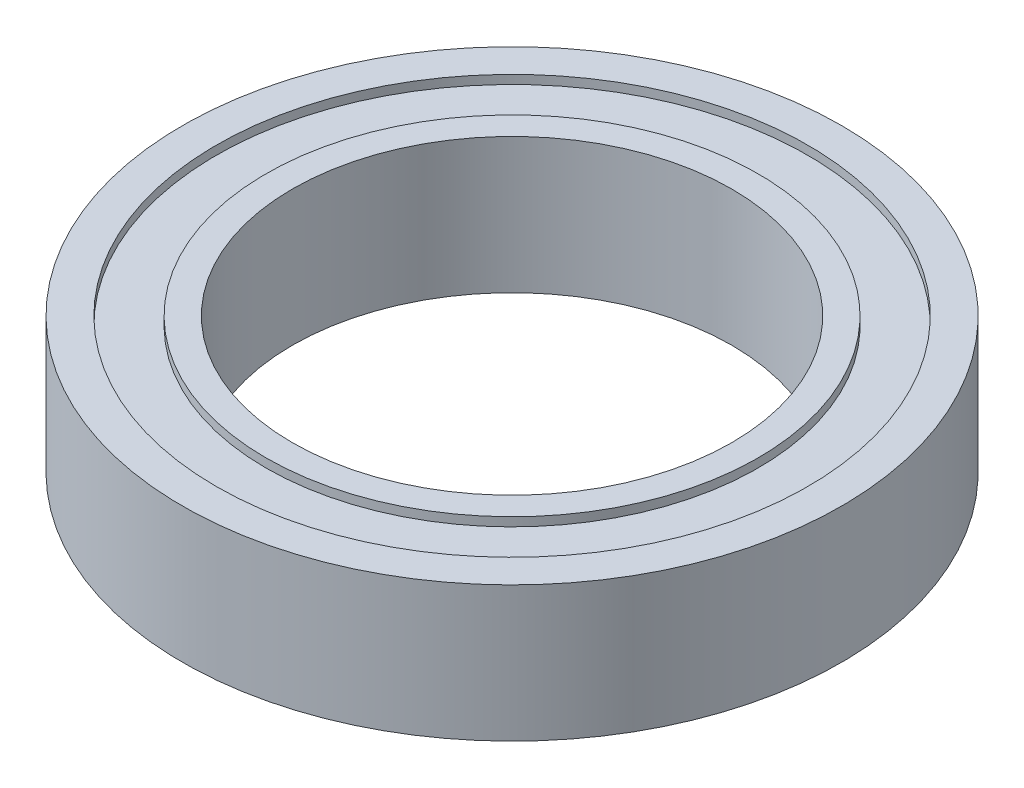
ISO-10303-21;
HEADER;
FILE_DESCRIPTION(('STEP AP214'),'2;1');
FILE_NAME('part.step','',(''),(''),'','','');
FILE_SCHEMA(('AUTOMOTIVE_DESIGN { 1 0 10303 214 1 1 1 1 }'));
ENDSEC;
DATA;
#1=APPLICATION_CONTEXT('core data for automotive mechanical design processes');
#2=APPLICATION_PROTOCOL_DEFINITION('international standard','automotive_design',2000,#1);
#3=PRODUCT_CONTEXT('',#1,'mechanical');
#4=PRODUCT('Part','Part','',(#3));
#5=PRODUCT_RELATED_PRODUCT_CATEGORY('part','',(#4));
#6=PRODUCT_DEFINITION_FORMATION('','',#4);
#7=PRODUCT_DEFINITION_CONTEXT('part definition',#1,'design');
#8=PRODUCT_DEFINITION('design','',#6,#7);
#9=PRODUCT_DEFINITION_SHAPE('','',#8);
#10=(LENGTH_UNIT() NAMED_UNIT(*) SI_UNIT(.MILLI.,.METRE.));
#11=(NAMED_UNIT(*) PLANE_ANGLE_UNIT() SI_UNIT($,.RADIAN.));
#12=(NAMED_UNIT(*) SI_UNIT($,.STERADIAN.) SOLID_ANGLE_UNIT());
#13=UNCERTAINTY_MEASURE_WITH_UNIT(LENGTH_MEASURE(1.E-05),#10,'distance_accuracy_value','');
#14=(GEOMETRIC_REPRESENTATION_CONTEXT(3) GLOBAL_UNCERTAINTY_ASSIGNED_CONTEXT((#13)) GLOBAL_UNIT_ASSIGNED_CONTEXT((#10,
#11,#12)) REPRESENTATION_CONTEXT('',''));
#15=CARTESIAN_POINT('',(0.,0.,0.));
#16=DIRECTION('',(0.,0.,1.));
#17=DIRECTION('',(1.,0.,0.));
#18=AXIS2_PLACEMENT_3D('',#15,#16,#17);
#19=CARTESIAN_POINT('',(0.,3.9116,0.));
#20=DIRECTION('',(0.,-1.,0.));
#21=DIRECTION('',(0.,0.,-1.));
#22=AXIS2_PLACEMENT_3D('',#19,#20,#21);
#23=CYLINDRICAL_SURFACE('',#22,6.35);
#24=CARTESIAN_POINT('',(0.,0.,0.));
#25=DIRECTION('',(0.,-1.,0.));
#26=DIRECTION('',(0.,0.,-1.));
#27=AXIS2_PLACEMENT_3D('',#24,#25,#26);
#28=CIRCLE('',#27,6.35);
#29=CARTESIAN_POINT('',(0.,0.,-6.35));
#30=VERTEX_POINT('',#29);
#31=EDGE_CURVE('E51',#30,#30,#28,.T.);
#32=ORIENTED_EDGE('',*,*,#31,.T.);
#33=EDGE_LOOP('',(#32));
#34=FACE_BOUND('',#33,.T.);
#35=CARTESIAN_POINT('',(0.,3.9116,0.));
#36=DIRECTION('',(0.,-1.,0.));
#37=DIRECTION('',(0.,0.,-1.));
#38=AXIS2_PLACEMENT_3D('',#35,#36,#37);
#39=CIRCLE('',#38,6.35);
#40=CARTESIAN_POINT('',(0.,3.9116,-6.35));
#41=VERTEX_POINT('',#40);
#42=EDGE_CURVE('E17',#41,#41,#39,.T.);
#43=ORIENTED_EDGE('',*,*,#42,.F.);
#44=EDGE_LOOP('',(#43));
#45=FACE_BOUND('',#44,.T.);
#46=ADVANCED_FACE('F14',(#34,#45),#23,.F.);
#47=CARTESIAN_POINT('',(0.,3.9116,0.));
#48=DIRECTION('',(0.,1.,0.));
#49=DIRECTION('',(0.,0.,1.));
#50=AXIS2_PLACEMENT_3D('',#47,#48,#49);
#51=PLANE('',#50);
#52=CARTESIAN_POINT('',(0.,3.9116,0.));
#53=DIRECTION('',(0.,1.,0.));
#54=DIRECTION('',(0.,0.,1.));
#55=AXIS2_PLACEMENT_3D('',#52,#53,#54);
#56=CIRCLE('',#55,7.112);
#57=CARTESIAN_POINT('',(0.,3.9116,7.112));
#58=VERTEX_POINT('',#57);
#59=EDGE_CURVE('E49',#58,#58,#56,.F.);
#60=ORIENTED_EDGE('',*,*,#59,.F.);
#61=EDGE_LOOP('',(#60));
#62=FACE_BOUND('',#61,.T.);
#63=ORIENTED_EDGE('',*,*,#42,.T.);
#64=EDGE_LOOP('',(#63));
#65=FACE_BOUND('',#64,.T.);
#66=ADVANCED_FACE('F58',(#62,#65),#51,.T.);
#67=CARTESIAN_POINT('',(0.,0.,0.));
#68=DIRECTION('',(0.,1.,0.));
#69=DIRECTION('',(0.,0.,1.));
#70=AXIS2_PLACEMENT_3D('',#67,#68,#69);
#71=PLANE('',#70);
#72=CARTESIAN_POINT('',(0.,0.,0.));
#73=DIRECTION('',(0.,-1.,0.));
#74=DIRECTION('',(0.,0.,-1.));
#75=AXIS2_PLACEMENT_3D('',#72,#73,#74);
#76=CIRCLE('',#75,7.112);
#77=CARTESIAN_POINT('',(0.,0.,-7.112));
#78=VERTEX_POINT('',#77);
#79=EDGE_CURVE('E46',#78,#78,#76,.F.);
#80=ORIENTED_EDGE('',*,*,#79,.F.);
#81=EDGE_LOOP('',(#80));
#82=FACE_BOUND('',#81,.T.);
#83=ORIENTED_EDGE('',*,*,#31,.F.);
#84=EDGE_LOOP('',(#83));
#85=FACE_BOUND('',#84,.T.);
#86=ADVANCED_FACE('F65',(#82,#85),#71,.F.);
#87=CARTESIAN_POINT('',(0.,3.6576,0.));
#88=DIRECTION('',(0.,1.,0.));
#89=DIRECTION('',(0.,0.,1.));
#90=AXIS2_PLACEMENT_3D('',#87,#88,#89);
#91=CYLINDRICAL_SURFACE('',#90,7.112);
#92=CARTESIAN_POINT('',(0.,3.6576,0.));
#93=DIRECTION('',(0.,1.,0.));
#94=DIRECTION('',(0.,0.,1.));
#95=AXIS2_PLACEMENT_3D('',#92,#93,#94);
#96=CIRCLE('',#95,7.112);
#97=CARTESIAN_POINT('',(0.,3.6576,7.112));
#98=VERTEX_POINT('',#97);
#99=EDGE_CURVE('E43',#98,#98,#96,.F.);
#100=ORIENTED_EDGE('',*,*,#99,.F.);
#101=EDGE_LOOP('',(#100));
#102=FACE_BOUND('',#101,.T.);
#103=ORIENTED_EDGE('',*,*,#59,.T.);
#104=EDGE_LOOP('',(#103));
#105=FACE_BOUND('',#104,.T.);
#106=ADVANCED_FACE('F101',(#102,#105),#91,.T.);
#107=CARTESIAN_POINT('',(0.,0.254,0.));
#108=DIRECTION('',(0.,-1.,0.));
#109=DIRECTION('',(0.,0.,-1.));
#110=AXIS2_PLACEMENT_3D('',#107,#108,#109);
#111=CYLINDRICAL_SURFACE('',#110,7.112);
#112=CARTESIAN_POINT('',(0.,0.254,0.));
#113=DIRECTION('',(0.,-1.,0.));
#114=DIRECTION('',(0.,0.,-1.));
#115=AXIS2_PLACEMENT_3D('',#112,#113,#114);
#116=CIRCLE('',#115,7.112);
#117=CARTESIAN_POINT('',(0.,0.254,-7.112));
#118=VERTEX_POINT('',#117);
#119=EDGE_CURVE('E40',#118,#118,#116,.F.);
#120=ORIENTED_EDGE('',*,*,#119,.F.);
#121=EDGE_LOOP('',(#120));
#122=FACE_BOUND('',#121,.T.);
#123=ORIENTED_EDGE('',*,*,#79,.T.);
#124=EDGE_LOOP('',(#123));
#125=FACE_BOUND('',#124,.T.);
#126=ADVANCED_FACE('F97',(#122,#125),#111,.T.);
#127=CARTESIAN_POINT('',(0.,3.6576,0.));
#128=DIRECTION('',(0.,1.,0.));
#129=DIRECTION('',(0.,0.,1.));
#130=AXIS2_PLACEMENT_3D('',#127,#128,#129);
#131=PLANE('',#130);
#132=CARTESIAN_POINT('',(0.,3.6576,0.));
#133=DIRECTION('',(0.,1.,0.));
#134=DIRECTION('',(0.,0.,1.));
#135=AXIS2_PLACEMENT_3D('',#132,#133,#134);
#136=CIRCLE('',#135,8.5471);
#137=CARTESIAN_POINT('',(0.,3.6576,8.5471));
#138=VERTEX_POINT('',#137);
#139=EDGE_CURVE('E37',#138,#138,#136,.T.);
#140=ORIENTED_EDGE('',*,*,#139,.T.);
#141=EDGE_LOOP('',(#140));
#142=FACE_BOUND('',#141,.T.);
#143=ORIENTED_EDGE('',*,*,#99,.T.);
#144=EDGE_LOOP('',(#143));
#145=FACE_BOUND('',#144,.T.);
#146=ADVANCED_FACE('F93',(#142,#145),#131,.T.);
#147=CARTESIAN_POINT('',(0.,0.254,0.));
#148=DIRECTION('',(0.,-1.,0.));
#149=DIRECTION('',(0.,0.,-1.));
#150=AXIS2_PLACEMENT_3D('',#147,#148,#149);
#151=PLANE('',#150);
#152=CARTESIAN_POINT('',(0.,0.254,0.));
#153=DIRECTION('',(0.,-1.,0.));
#154=DIRECTION('',(0.,0.,-1.));
#155=AXIS2_PLACEMENT_3D('',#152,#153,#154);
#156=CIRCLE('',#155,8.5471);
#157=CARTESIAN_POINT('',(0.,0.254,-8.5471));
#158=VERTEX_POINT('',#157);
#159=EDGE_CURVE('E34',#158,#158,#156,.T.);
#160=ORIENTED_EDGE('',*,*,#159,.T.);
#161=EDGE_LOOP('',(#160));
#162=FACE_BOUND('',#161,.T.);
#163=ORIENTED_EDGE('',*,*,#119,.T.);
#164=EDGE_LOOP('',(#163));
#165=FACE_BOUND('',#164,.T.);
#166=ADVANCED_FACE('F89',(#162,#165),#151,.T.);
#167=CARTESIAN_POINT('',(0.,3.6576,0.));
#168=DIRECTION('',(0.,1.,0.));
#169=DIRECTION('',(0.,0.,1.));
#170=AXIS2_PLACEMENT_3D('',#167,#168,#169);
#171=CYLINDRICAL_SURFACE('',#170,8.5471);
#172=CARTESIAN_POINT('',(0.,3.9116,0.));
#173=DIRECTION('',(0.,1.,0.));
#174=DIRECTION('',(0.,0.,1.));
#175=AXIS2_PLACEMENT_3D('',#172,#173,#174);
#176=CIRCLE('',#175,8.5471);
#177=CARTESIAN_POINT('',(0.,3.9116,8.5471));
#178=VERTEX_POINT('',#177);
#179=EDGE_CURVE('E31',#178,#178,#176,.F.);
#180=ORIENTED_EDGE('',*,*,#179,.F.);
#181=EDGE_LOOP('',(#180));
#182=FACE_BOUND('',#181,.T.);
#183=ORIENTED_EDGE('',*,*,#139,.F.);
#184=EDGE_LOOP('',(#183));
#185=FACE_BOUND('',#184,.T.);
#186=ADVANCED_FACE('F85',(#182,#185),#171,.F.);
#187=CARTESIAN_POINT('',(0.,0.254,0.));
#188=DIRECTION('',(0.,-1.,0.));
#189=DIRECTION('',(0.,0.,-1.));
#190=AXIS2_PLACEMENT_3D('',#187,#188,#189);
#191=CYLINDRICAL_SURFACE('',#190,8.5471);
#192=ORIENTED_EDGE('',*,*,#159,.F.);
#193=EDGE_LOOP('',(#192));
#194=FACE_BOUND('',#193,.T.);
#195=CARTESIAN_POINT('',(0.,0.,0.));
#196=DIRECTION('',(0.,-1.,0.));
#197=DIRECTION('',(0.,0.,-1.));
#198=AXIS2_PLACEMENT_3D('',#195,#196,#197);
#199=CIRCLE('',#198,8.5471);
#200=CARTESIAN_POINT('',(0.,0.,-8.5471));
#201=VERTEX_POINT('',#200);
#202=EDGE_CURVE('E26',#201,#201,#199,.T.);
#203=ORIENTED_EDGE('',*,*,#202,.T.);
#204=EDGE_LOOP('',(#203));
#205=FACE_BOUND('',#204,.T.);
#206=ADVANCED_FACE('F81',(#194,#205),#191,.F.);
#207=CARTESIAN_POINT('',(0.,3.9116,0.));
#208=DIRECTION('',(0.,1.,0.));
#209=DIRECTION('',(0.,0.,1.));
#210=AXIS2_PLACEMENT_3D('',#207,#208,#209);
#211=PLANE('',#210);
#212=CARTESIAN_POINT('',(0.,3.9116,0.));
#213=DIRECTION('',(0.,-1.,0.));
#214=DIRECTION('',(0.,0.,-1.));
#215=AXIS2_PLACEMENT_3D('',#212,#213,#214);
#216=CIRCLE('',#215,9.525);
#217=CARTESIAN_POINT('',(0.,3.9116,-9.525));
#218=VERTEX_POINT('',#217);
#219=EDGE_CURVE('E21',#218,#218,#216,.T.);
#220=ORIENTED_EDGE('',*,*,#219,.F.);
#221=EDGE_LOOP('',(#220));
#222=FACE_BOUND('',#221,.T.);
#223=ORIENTED_EDGE('',*,*,#179,.T.);
#224=EDGE_LOOP('',(#223));
#225=FACE_BOUND('',#224,.T.);
#226=ADVANCED_FACE('F74',(#222,#225),#211,.T.);
#227=CARTESIAN_POINT('',(0.,0.,0.));
#228=DIRECTION('',(0.,1.,0.));
#229=DIRECTION('',(0.,0.,1.));
#230=AXIS2_PLACEMENT_3D('',#227,#228,#229);
#231=PLANE('',#230);
#232=CARTESIAN_POINT('',(0.,0.,0.));
#233=DIRECTION('',(0.,-1.,0.));
#234=DIRECTION('',(0.,0.,-1.));
#235=AXIS2_PLACEMENT_3D('',#232,#233,#234);
#236=CIRCLE('',#235,9.525);
#237=CARTESIAN_POINT('',(0.,0.,-9.525));
#238=VERTEX_POINT('',#237);
#239=EDGE_CURVE('E9',#238,#238,#236,.F.);
#240=ORIENTED_EDGE('',*,*,#239,.F.);
#241=EDGE_LOOP('',(#240));
#242=FACE_BOUND('',#241,.T.);
#243=ORIENTED_EDGE('',*,*,#202,.F.);
#244=EDGE_LOOP('',(#243));
#245=FACE_BOUND('',#244,.T.);
#246=ADVANCED_FACE('F69',(#242,#245),#231,.F.);
#247=CARTESIAN_POINT('',(0.,3.9116,0.));
#248=DIRECTION('',(0.,-1.,0.));
#249=DIRECTION('',(0.,0.,-1.));
#250=AXIS2_PLACEMENT_3D('',#247,#248,#249);
#251=CYLINDRICAL_SURFACE('',#250,9.525);
#252=ORIENTED_EDGE('',*,*,#239,.T.);
#253=EDGE_LOOP('',(#252));
#254=FACE_BOUND('',#253,.T.);
#255=ORIENTED_EDGE('',*,*,#219,.T.);
#256=EDGE_LOOP('',(#255));
#257=FACE_BOUND('',#256,.T.);
#258=ADVANCED_FACE('F67',(#254,#257),#251,.T.);
#259=CLOSED_SHELL('',(#46,#66,#86,#106,#126,#146,#166,#186,#206,#226,#246,#258));
#260=MANIFOLD_SOLID_BREP('B1',#259);
#261=ADVANCED_BREP_SHAPE_REPRESENTATION('',(#18,#260),#14);
#262=SHAPE_DEFINITION_REPRESENTATION(#9,#261);
ENDSEC;
END-ISO-10303-21;
